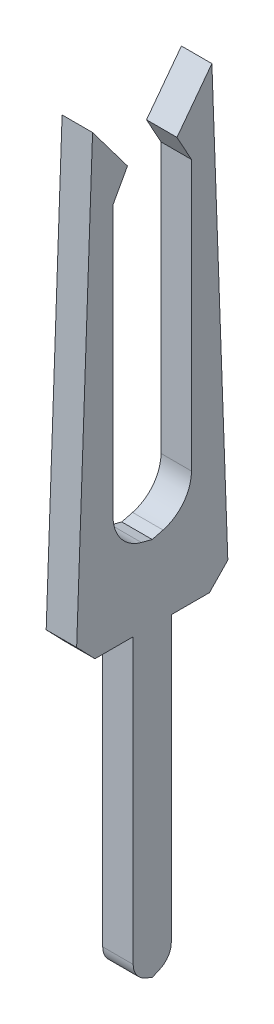
ISO-10303-21;
HEADER;
FILE_DESCRIPTION(('STEP AP214'),'2;1');
FILE_NAME('part.step','',(''),(''),'','','');
FILE_SCHEMA(('AUTOMOTIVE_DESIGN { 1 0 10303 214 1 1 1 1 }'));
ENDSEC;
DATA;
#1=APPLICATION_CONTEXT('core data for automotive mechanical design processes');
#2=APPLICATION_PROTOCOL_DEFINITION('international standard','automotive_design',2000,#1);
#3=PRODUCT_CONTEXT('',#1,'mechanical');
#4=PRODUCT('Part','Part','',(#3));
#5=PRODUCT_RELATED_PRODUCT_CATEGORY('part','',(#4));
#6=PRODUCT_DEFINITION_FORMATION('','',#4);
#7=PRODUCT_DEFINITION_CONTEXT('part definition',#1,'design');
#8=PRODUCT_DEFINITION('design','',#6,#7);
#9=PRODUCT_DEFINITION_SHAPE('','',#8);
#10=(LENGTH_UNIT() NAMED_UNIT(*) SI_UNIT(.MILLI.,.METRE.));
#11=(NAMED_UNIT(*) PLANE_ANGLE_UNIT() SI_UNIT($,.RADIAN.));
#12=(NAMED_UNIT(*) SI_UNIT($,.STERADIAN.) SOLID_ANGLE_UNIT());
#13=UNCERTAINTY_MEASURE_WITH_UNIT(LENGTH_MEASURE(1.E-05),#10,'distance_accuracy_value','');
#14=(GEOMETRIC_REPRESENTATION_CONTEXT(3) GLOBAL_UNCERTAINTY_ASSIGNED_CONTEXT((#13)) GLOBAL_UNIT_ASSIGNED_CONTEXT((#10,
#11,#12)) REPRESENTATION_CONTEXT('',''));
#15=CARTESIAN_POINT('',(0.,0.,0.));
#16=DIRECTION('',(0.,0.,1.));
#17=DIRECTION('',(1.,0.,0.));
#18=AXIS2_PLACEMENT_3D('',#15,#16,#17);
#19=CARTESIAN_POINT('',(0.4,2.15627423693323,0.277438328452502));
#20=DIRECTION('',(0.,0.694137309805425,0.71984261831048));
#21=DIRECTION('',(0.,-0.71984261831048,0.694137309805425));
#22=AXIS2_PLACEMENT_3D('',#19,#20,#21);
#23=PLANE('',#22);
#24=DIRECTION('',(0.,0.71984261831048,-0.694137309805425));
#25=VECTOR('',#24,1.);
#26=CARTESIAN_POINT('',(0.,2.15627423693323,0.277438328452502));
#27=LINE('',#26,#25);
#28=CARTESIAN_POINT('',(0.,1.90643942765456,0.518351630884458));
#29=VERTEX_POINT('',#28);
#30=CARTESIAN_POINT('',(0.,2.15627423693323,0.277438328452502));
#31=VERTEX_POINT('',#30);
#32=EDGE_CURVE('E222',#29,#31,#27,.T.);
#33=ORIENTED_EDGE('',*,*,#32,.T.);
#34=DIRECTION('',(-1.,0.,0.));
#35=VECTOR('',#34,1.);
#36=CARTESIAN_POINT('',(0.4,2.15627423693323,0.277438328452502));
#37=LINE('',#36,#35);
#38=CARTESIAN_POINT('',(0.4,2.15627423693323,0.277438328452502));
#39=VERTEX_POINT('',#38);
#40=EDGE_CURVE('E11',#39,#31,#37,.T.);
#41=ORIENTED_EDGE('',*,*,#40,.F.);
#42=DIRECTION('',(0.,0.71984261831048,-0.694137309805425));
#43=VECTOR('',#42,1.);
#44=CARTESIAN_POINT('',(0.4,2.15627423693323,0.277438328452502));
#45=LINE('',#44,#43);
#46=CARTESIAN_POINT('',(0.4,1.90643942765456,0.518351630884458));
#47=VERTEX_POINT('',#46);
#48=EDGE_CURVE('E285',#47,#39,#45,.T.);
#49=ORIENTED_EDGE('',*,*,#48,.F.);
#50=DIRECTION('',(-1.,0.,0.));
#51=VECTOR('',#50,1.);
#52=CARTESIAN_POINT('',(0.4,1.90643942765456,0.518351630884458));
#53=LINE('',#52,#51);
#54=EDGE_CURVE('E218',#47,#29,#53,.T.);
#55=ORIENTED_EDGE('',*,*,#54,.T.);
#56=EDGE_LOOP('',(#33,#41,#49,#55));
#57=FACE_BOUND('',#56,.T.);
#58=ADVANCED_FACE('F36',(#57),#23,.F.);
#59=CARTESIAN_POINT('',(0.4,7.90643942765456,0.486576567456251));
#60=DIRECTION('',(0.,-0.036346790272175,0.99933923711466));
#61=DIRECTION('',(0.,-0.99933923711466,-0.036346790272175));
#62=AXIS2_PLACEMENT_3D('',#59,#60,#61);
#63=PLANE('',#62);
#64=DIRECTION('',(0.,0.99933923711466,0.036346790272175));
#65=VECTOR('',#64,1.);
#66=CARTESIAN_POINT('',(0.,7.90643942765456,0.486576567456251));
#67=LINE('',#66,#65);
#68=CARTESIAN_POINT('',(0.,7.90643942765456,0.486576567456251));
#69=VERTEX_POINT('',#68);
#70=EDGE_CURVE('E226',#31,#69,#67,.T.);
#71=ORIENTED_EDGE('',*,*,#70,.T.);
#72=DIRECTION('',(-1.,0.,0.));
#73=VECTOR('',#72,1.);
#74=CARTESIAN_POINT('',(0.4,7.90643942765456,0.486576567456251));
#75=LINE('',#74,#73);
#76=CARTESIAN_POINT('',(0.4,7.90643942765456,0.486576567456251));
#77=VERTEX_POINT('',#76);
#78=EDGE_CURVE('E45',#77,#69,#75,.T.);
#79=ORIENTED_EDGE('',*,*,#78,.F.);
#80=DIRECTION('',(0.,0.99933923711466,0.036346790272175));
#81=VECTOR('',#80,1.);
#82=CARTESIAN_POINT('',(0.4,7.90643942765456,0.486576567456251));
#83=LINE('',#82,#81);
#84=EDGE_CURVE('E138',#39,#77,#83,.T.);
#85=ORIENTED_EDGE('',*,*,#84,.F.);
#86=ORIENTED_EDGE('',*,*,#40,.T.);
#87=EDGE_LOOP('',(#71,#79,#85,#86));
#88=FACE_BOUND('',#87,.T.);
#89=ADVANCED_FACE('F449',(#88),#63,.F.);
#90=CARTESIAN_POINT('',(0.4,7.29691604158744,0.944947879463951));
#91=DIRECTION('',(0.,-0.601030672473663,-0.799225957252301));
#92=DIRECTION('',(0.,0.799225957252301,-0.601030672473663));
#93=AXIS2_PLACEMENT_3D('',#90,#91,#92);
#94=PLANE('',#93);
#95=DIRECTION('',(0.,-0.799225957252301,0.601030672473663));
#96=VECTOR('',#95,1.);
#97=CARTESIAN_POINT('',(0.,7.29691604158744,0.944947879463951));
#98=LINE('',#97,#96);
#99=CARTESIAN_POINT('',(0.,7.29691604158744,0.944947879463951));
#100=VERTEX_POINT('',#99);
#101=EDGE_CURVE('E229',#69,#100,#98,.T.);
#102=ORIENTED_EDGE('',*,*,#101,.T.);
#103=DIRECTION('',(-1.,0.,0.));
#104=VECTOR('',#103,1.);
#105=CARTESIAN_POINT('',(0.4,7.29691604158744,0.944947879463951));
#106=LINE('',#105,#104);
#107=CARTESIAN_POINT('',(0.4,7.29691604158744,0.944947879463951));
#108=VERTEX_POINT('',#107);
#109=EDGE_CURVE('E352',#108,#100,#106,.T.);
#110=ORIENTED_EDGE('',*,*,#109,.F.);
#111=DIRECTION('',(0.,-0.799225957252301,0.601030672473663));
#112=VECTOR('',#111,1.);
#113=CARTESIAN_POINT('',(0.4,7.29691604158744,0.944947879463951));
#114=LINE('',#113,#112);
#115=EDGE_CURVE('E362',#77,#108,#114,.T.);
#116=ORIENTED_EDGE('',*,*,#115,.F.);
#117=ORIENTED_EDGE('',*,*,#78,.T.);
#118=EDGE_LOOP('',(#102,#110,#116,#117));
#119=FACE_BOUND('',#118,.T.);
#120=ADVANCED_FACE('F360',(#119),#94,.F.);
#121=CARTESIAN_POINT('',(0.4,6.95011825296304,0.754777343997982));
#122=DIRECTION('',(0.,0.480815317239039,-0.876821892238283));
#123=DIRECTION('',(0.,0.876821892238283,0.480815317239039));
#124=AXIS2_PLACEMENT_3D('',#121,#122,#123);
#125=PLANE('',#124);
#126=DIRECTION('',(0.,-0.876821892238283,-0.480815317239039));
#127=VECTOR('',#126,1.);
#128=CARTESIAN_POINT('',(0.,6.95011825296304,0.754777343997982));
#129=LINE('',#128,#127);
#130=CARTESIAN_POINT('',(0.,6.95011825296304,0.754777343997982));
#131=VERTEX_POINT('',#130);
#132=EDGE_CURVE('E232',#100,#131,#129,.T.);
#133=ORIENTED_EDGE('',*,*,#132,.T.);
#134=DIRECTION('',(-1.,0.,0.));
#135=VECTOR('',#134,1.);
#136=CARTESIAN_POINT('',(0.4,6.95011825296304,0.754777343997982));
#137=LINE('',#136,#135);
#138=CARTESIAN_POINT('',(0.4,6.95011825296304,0.754777343997982));
#139=VERTEX_POINT('',#138);
#140=EDGE_CURVE('E348',#139,#131,#137,.T.);
#141=ORIENTED_EDGE('',*,*,#140,.F.);
#142=DIRECTION('',(0.,-0.876821892238283,-0.480815317239039));
#143=VECTOR('',#142,1.);
#144=CARTESIAN_POINT('',(0.4,6.95011825296304,0.754777343997982));
#145=LINE('',#144,#143);
#146=EDGE_CURVE('E381',#108,#139,#145,.T.);
#147=ORIENTED_EDGE('',*,*,#146,.F.);
#148=ORIENTED_EDGE('',*,*,#109,.T.);
#149=EDGE_LOOP('',(#133,#141,#147,#148));
#150=FACE_BOUND('',#149,.T.);
#151=ADVANCED_FACE('F371',(#150),#125,.F.);
#152=CARTESIAN_POINT('',(0.4,3.40759606010662,0.754710604299908));
#153=DIRECTION('',(0.,1.88395991410638E-05,-0.999999999822535));
#154=DIRECTION('',(0.,0.999999999822535,1.88395991410638E-05));
#155=AXIS2_PLACEMENT_3D('',#152,#153,#154);
#156=PLANE('',#155);
#157=DIRECTION('',(0.,-0.999999999822535,-1.88395991410638E-05));
#158=VECTOR('',#157,1.);
#159=CARTESIAN_POINT('',(0.,3.40759606010662,0.754710604299908));
#160=LINE('',#159,#158);
#161=CARTESIAN_POINT('',(0.,3.40759606010662,0.754710604299908));
#162=VERTEX_POINT('',#161);
#163=EDGE_CURVE('E235',#131,#162,#160,.T.);
#164=ORIENTED_EDGE('',*,*,#163,.T.);
#165=DIRECTION('',(-1.,0.,0.));
#166=VECTOR('',#165,1.);
#167=CARTESIAN_POINT('',(0.4,3.40759606010662,0.754710604299908));
#168=LINE('',#167,#166);
#169=CARTESIAN_POINT('',(0.4,3.40759606010662,0.754710604299908));
#170=VERTEX_POINT('',#169);
#171=EDGE_CURVE('E344',#170,#162,#168,.T.);
#172=ORIENTED_EDGE('',*,*,#171,.F.);
#173=DIRECTION('',(0.,-0.999999999822535,-1.88395991410638E-05));
#174=VECTOR('',#173,1.);
#175=CARTESIAN_POINT('',(0.4,3.40759606010662,0.754710604299908));
#176=LINE('',#175,#174);
#177=EDGE_CURVE('E377',#139,#170,#176,.T.);
#178=ORIENTED_EDGE('',*,*,#177,.F.);
#179=ORIENTED_EDGE('',*,*,#140,.T.);
#180=EDGE_LOOP('',(#164,#172,#178,#179));
#181=FACE_BOUND('',#180,.T.);
#182=ADVANCED_FACE('F375',(#181),#156,.F.);
#183=CARTESIAN_POINT('',(0.4,3.40758664030705,1.25471060421118));
#184=DIRECTION('',(-1.,0.,0.));
#185=DIRECTION('',(0.,0.,1.));
#186=AXIS2_PLACEMENT_3D('',#183,#184,#185);
#187=CYLINDRICAL_SURFACE('',#186,0.5);
#188=CARTESIAN_POINT('',(0.,3.40758664030705,1.25471060421118));
#189=DIRECTION('',(-1.,0.,0.));
#190=DIRECTION('',(0.,0.,-1.));
#191=AXIS2_PLACEMENT_3D('',#188,#189,#190);
#192=CIRCLE('',#191,0.5);
#193=CARTESIAN_POINT('',(0.,2.92391221511593,1.127986295509));
#194=VERTEX_POINT('',#193);
#195=EDGE_CURVE('E238',#162,#194,#192,.T.);
#196=ORIENTED_EDGE('',*,*,#195,.T.);
#197=DIRECTION('',(-1.,0.,0.));
#198=VECTOR('',#197,1.);
#199=CARTESIAN_POINT('',(0.4,2.92391221511593,1.127986295509));
#200=LINE('',#199,#198);
#201=CARTESIAN_POINT('',(0.4,2.92391221511593,1.127986295509));
#202=VERTEX_POINT('',#201);
#203=EDGE_CURVE('E340',#202,#194,#200,.T.);
#204=ORIENTED_EDGE('',*,*,#203,.F.);
#205=CARTESIAN_POINT('',(0.4,3.40758664030705,1.25471060421118));
#206=DIRECTION('',(-1.,0.,0.));
#207=DIRECTION('',(0.,0.,-1.));
#208=AXIS2_PLACEMENT_3D('',#205,#206,#207);
#209=CIRCLE('',#208,0.5);
#210=EDGE_CURVE('E380',#170,#202,#209,.T.);
#211=ORIENTED_EDGE('',*,*,#210,.F.);
#212=ORIENTED_EDGE('',*,*,#171,.T.);
#213=EDGE_LOOP('',(#196,#204,#211,#212));
#214=FACE_BOUND('',#213,.T.);
#215=ADVANCED_FACE('F462',(#214),#187,.F.);
#216=CARTESIAN_POINT('',(0.4,2.88671780777912,1.26994787946395));
#217=DIRECTION('',(0.,-0.967348850382229,-0.253448617404358));
#218=DIRECTION('',(0.,0.253448617404358,-0.967348850382229));
#219=AXIS2_PLACEMENT_3D('',#216,#217,#218);
#220=PLANE('',#219);
#221=DIRECTION('',(0.,-0.253448617404358,0.967348850382229));
#222=VECTOR('',#221,1.);
#223=CARTESIAN_POINT('',(0.,2.88671780777912,1.26994787946395));
#224=LINE('',#223,#222);
#225=CARTESIAN_POINT('',(0.,2.88671780777912,1.26994787946395));
#226=VERTEX_POINT('',#225);
#227=EDGE_CURVE('E241',#194,#226,#224,.T.);
#228=ORIENTED_EDGE('',*,*,#227,.T.);
#229=DIRECTION('',(-1.,0.,0.));
#230=VECTOR('',#229,1.);
#231=CARTESIAN_POINT('',(0.4,2.88671780777912,1.26994787946395));
#232=LINE('',#231,#230);
#233=CARTESIAN_POINT('',(0.4,2.88671780777912,1.26994787946395));
#234=VERTEX_POINT('',#233);
#235=EDGE_CURVE('E336',#234,#226,#232,.T.);
#236=ORIENTED_EDGE('',*,*,#235,.F.);
#237=DIRECTION('',(0.,-0.253448617404358,0.967348850382229));
#238=VECTOR('',#237,1.);
#239=CARTESIAN_POINT('',(0.4,2.88671780777912,1.26994787946395));
#240=LINE('',#239,#238);
#241=EDGE_CURVE('E384',#202,#234,#240,.T.);
#242=ORIENTED_EDGE('',*,*,#241,.F.);
#243=ORIENTED_EDGE('',*,*,#203,.T.);
#244=EDGE_LOOP('',(#228,#236,#242,#243));
#245=FACE_BOUND('',#244,.T.);
#246=ADVANCED_FACE('F465',(#245),#220,.F.);
#247=CARTESIAN_POINT('',(0.4,2.88671780777912,1.26994787946395));
#248=DIRECTION('',(0.,-0.967348850382229,0.253448617404358));
#249=DIRECTION('',(0.,-0.253448617404358,-0.967348850382229));
#250=AXIS2_PLACEMENT_3D('',#247,#248,#249);
#251=PLANE('',#250);
#252=DIRECTION('',(0.,0.253448617404358,0.967348850382229));
#253=VECTOR('',#252,1.);
#254=CARTESIAN_POINT('',(0.,2.88671780777912,1.26994787946395));
#255=LINE('',#254,#253);
#256=CARTESIAN_POINT('',(0.,2.92391221511593,1.4119094634189));
#257=VERTEX_POINT('',#256);
#258=EDGE_CURVE('E244',#226,#257,#255,.T.);
#259=ORIENTED_EDGE('',*,*,#258,.T.);
#260=DIRECTION('',(-1.,0.,0.));
#261=VECTOR('',#260,1.);
#262=CARTESIAN_POINT('',(0.4,2.92391221511593,1.4119094634189));
#263=LINE('',#262,#261);
#264=CARTESIAN_POINT('',(0.4,2.92391221511593,1.4119094634189));
#265=VERTEX_POINT('',#264);
#266=EDGE_CURVE('E332',#265,#257,#263,.T.);
#267=ORIENTED_EDGE('',*,*,#266,.F.);
#268=DIRECTION('',(0.,0.253448617404358,0.967348850382229));
#269=VECTOR('',#268,1.);
#270=CARTESIAN_POINT('',(0.4,2.88671780777912,1.26994787946395));
#271=LINE('',#270,#269);
#272=EDGE_CURVE('E392',#234,#265,#271,.T.);
#273=ORIENTED_EDGE('',*,*,#272,.F.);
#274=ORIENTED_EDGE('',*,*,#235,.T.);
#275=EDGE_LOOP('',(#259,#267,#273,#274));
#276=FACE_BOUND('',#275,.T.);
#277=ADVANCED_FACE('F469',(#276),#251,.F.);
#278=CARTESIAN_POINT('',(0.4,3.40758664030705,1.28518515471672));
#279=DIRECTION('',(-1.,0.,0.));
#280=DIRECTION('',(0.,0.,1.));
#281=AXIS2_PLACEMENT_3D('',#278,#279,#280);
#282=CYLINDRICAL_SURFACE('',#281,0.5);
#283=CARTESIAN_POINT('',(0.,3.40758664030705,1.28518515471672));
#284=DIRECTION('',(-1.,0.,0.));
#285=DIRECTION('',(0.,0.,1.));
#286=AXIS2_PLACEMENT_3D('',#283,#284,#285);
#287=CIRCLE('',#286,0.5);
#288=CARTESIAN_POINT('',(0.,3.40759606010662,1.78518515462799));
#289=VERTEX_POINT('',#288);
#290=EDGE_CURVE('E247',#257,#289,#287,.T.);
#291=ORIENTED_EDGE('',*,*,#290,.T.);
#292=DIRECTION('',(-1.,0.,0.));
#293=VECTOR('',#292,1.);
#294=CARTESIAN_POINT('',(0.4,3.40759606010662,1.78518515462799));
#295=LINE('',#294,#293);
#296=CARTESIAN_POINT('',(0.4,3.40759606010662,1.78518515462799));
#297=VERTEX_POINT('',#296);
#298=EDGE_CURVE('E328',#297,#289,#295,.T.);
#299=ORIENTED_EDGE('',*,*,#298,.F.);
#300=CARTESIAN_POINT('',(0.4,3.40758664030705,1.28518515471672));
#301=DIRECTION('',(-1.,0.,0.));
#302=DIRECTION('',(0.,0.,1.));
#303=AXIS2_PLACEMENT_3D('',#300,#301,#302);
#304=CIRCLE('',#303,0.5);
#305=EDGE_CURVE('E395',#265,#297,#304,.T.);
#306=ORIENTED_EDGE('',*,*,#305,.F.);
#307=ORIENTED_EDGE('',*,*,#266,.T.);
#308=EDGE_LOOP('',(#291,#299,#306,#307));
#309=FACE_BOUND('',#308,.T.);
#310=ADVANCED_FACE('F473',(#309),#282,.F.);
#311=CARTESIAN_POINT('',(0.4,3.40759606010662,1.78518515462799));
#312=DIRECTION('',(0.,1.88395991408802E-05,0.999999999822535));
#313=DIRECTION('',(0.,-0.999999999822535,1.88395991408802E-05));
#314=AXIS2_PLACEMENT_3D('',#311,#312,#313);
#315=PLANE('',#314);
#316=DIRECTION('',(0.,0.999999999822535,-1.88395991408802E-05));
#317=VECTOR('',#316,1.);
#318=CARTESIAN_POINT('',(0.,3.40759606010662,1.78518515462799));
#319=LINE('',#318,#317);
#320=CARTESIAN_POINT('',(0.,6.95011825296304,1.78511841492992));
#321=VERTEX_POINT('',#320);
#322=EDGE_CURVE('E250',#289,#321,#319,.T.);
#323=ORIENTED_EDGE('',*,*,#322,.T.);
#324=DIRECTION('',(-1.,0.,0.));
#325=VECTOR('',#324,1.);
#326=CARTESIAN_POINT('',(0.4,6.95011825296304,1.78511841492992));
#327=LINE('',#326,#325);
#328=CARTESIAN_POINT('',(0.4,6.95011825296304,1.78511841492992));
#329=VERTEX_POINT('',#328);
#330=EDGE_CURVE('E324',#329,#321,#327,.T.);
#331=ORIENTED_EDGE('',*,*,#330,.F.);
#332=DIRECTION('',(0.,0.999999999822535,-1.88395991408802E-05));
#333=VECTOR('',#332,1.);
#334=CARTESIAN_POINT('',(0.4,3.40759606010662,1.78518515462799));
#335=LINE('',#334,#333);
#336=EDGE_CURVE('E398',#297,#329,#335,.T.);
#337=ORIENTED_EDGE('',*,*,#336,.F.);
#338=ORIENTED_EDGE('',*,*,#298,.T.);
#339=EDGE_LOOP('',(#323,#331,#337,#338));
#340=FACE_BOUND('',#339,.T.);
#341=ADVANCED_FACE('F477',(#340),#315,.F.);
#342=CARTESIAN_POINT('',(0.4,6.95011825296304,1.78511841492992));
#343=DIRECTION('',(0.,0.480815317239038,0.876821892238283));
#344=DIRECTION('',(0.,-0.876821892238283,0.480815317239038));
#345=AXIS2_PLACEMENT_3D('',#342,#343,#344);
#346=PLANE('',#345);
#347=DIRECTION('',(0.,0.876821892238283,-0.480815317239038));
#348=VECTOR('',#347,1.);
#349=CARTESIAN_POINT('',(0.,6.95011825296304,1.78511841492992));
#350=LINE('',#349,#348);
#351=CARTESIAN_POINT('',(0.,7.29691604158744,1.59494787946395));
#352=VERTEX_POINT('',#351);
#353=EDGE_CURVE('E253',#321,#352,#350,.T.);
#354=ORIENTED_EDGE('',*,*,#353,.T.);
#355=DIRECTION('',(-1.,0.,0.));
#356=VECTOR('',#355,1.);
#357=CARTESIAN_POINT('',(0.4,7.29691604158744,1.59494787946395));
#358=LINE('',#357,#356);
#359=CARTESIAN_POINT('',(0.4,7.29691604158744,1.59494787946395));
#360=VERTEX_POINT('',#359);
#361=EDGE_CURVE('E320',#360,#352,#358,.T.);
#362=ORIENTED_EDGE('',*,*,#361,.F.);
#363=DIRECTION('',(0.,0.876821892238283,-0.480815317239038));
#364=VECTOR('',#363,1.);
#365=CARTESIAN_POINT('',(0.4,6.95011825296304,1.78511841492992));
#366=LINE('',#365,#364);
#367=EDGE_CURVE('E401',#329,#360,#366,.T.);
#368=ORIENTED_EDGE('',*,*,#367,.F.);
#369=ORIENTED_EDGE('',*,*,#330,.T.);
#370=EDGE_LOOP('',(#354,#362,#368,#369));
#371=FACE_BOUND('',#370,.T.);
#372=ADVANCED_FACE('F481',(#371),#346,.F.);
#373=CARTESIAN_POINT('',(0.4,7.29691604158744,1.59494787946395));
#374=DIRECTION('',(0.,-0.601030672473662,0.799225957252301));
#375=DIRECTION('',(0.,-0.799225957252301,-0.601030672473662));
#376=AXIS2_PLACEMENT_3D('',#373,#374,#375);
#377=PLANE('',#376);
#378=DIRECTION('',(0.,0.799225957252301,0.601030672473662));
#379=VECTOR('',#378,1.);
#380=CARTESIAN_POINT('',(0.,7.29691604158744,1.59494787946395));
#381=LINE('',#380,#379);
#382=CARTESIAN_POINT('',(0.,7.90643942765456,2.05331919147165));
#383=VERTEX_POINT('',#382);
#384=EDGE_CURVE('E256',#352,#383,#381,.T.);
#385=ORIENTED_EDGE('',*,*,#384,.T.);
#386=DIRECTION('',(-1.,0.,0.));
#387=VECTOR('',#386,1.);
#388=CARTESIAN_POINT('',(0.4,7.90643942765456,2.05331919147165));
#389=LINE('',#388,#387);
#390=CARTESIAN_POINT('',(0.4,7.90643942765456,2.05331919147165));
#391=VERTEX_POINT('',#390);
#392=EDGE_CURVE('E316',#391,#383,#389,.T.);
#393=ORIENTED_EDGE('',*,*,#392,.F.);
#394=DIRECTION('',(0.,0.799225957252301,0.601030672473662));
#395=VECTOR('',#394,1.);
#396=CARTESIAN_POINT('',(0.4,7.29691604158744,1.59494787946395));
#397=LINE('',#396,#395);
#398=EDGE_CURVE('E404',#360,#391,#397,.T.);
#399=ORIENTED_EDGE('',*,*,#398,.F.);
#400=ORIENTED_EDGE('',*,*,#361,.T.);
#401=EDGE_LOOP('',(#385,#393,#399,#400));
#402=FACE_BOUND('',#401,.T.);
#403=ADVANCED_FACE('F485',(#402),#377,.F.);
#404=CARTESIAN_POINT('',(0.4,7.90643942765456,2.05331919147165));
#405=DIRECTION('',(0.,-0.0363467902721749,-0.99933923711466));
#406=DIRECTION('',(0.,0.99933923711466,-0.0363467902721749));
#407=AXIS2_PLACEMENT_3D('',#404,#405,#406);
#408=PLANE('',#407);
#409=DIRECTION('',(0.,-0.99933923711466,0.0363467902721749));
#410=VECTOR('',#409,1.);
#411=CARTESIAN_POINT('',(0.,7.90643942765456,2.05331919147165));
#412=LINE('',#411,#410);
#413=CARTESIAN_POINT('',(0.,2.15627423693323,2.26245743047539));
#414=VERTEX_POINT('',#413);
#415=EDGE_CURVE('E259',#383,#414,#412,.T.);
#416=ORIENTED_EDGE('',*,*,#415,.T.);
#417=DIRECTION('',(-1.,0.,0.));
#418=VECTOR('',#417,1.);
#419=CARTESIAN_POINT('',(0.4,2.15627423693323,2.26245743047539));
#420=LINE('',#419,#418);
#421=CARTESIAN_POINT('',(0.4,2.15627423693323,2.26245743047539));
#422=VERTEX_POINT('',#421);
#423=EDGE_CURVE('E312',#422,#414,#420,.T.);
#424=ORIENTED_EDGE('',*,*,#423,.F.);
#425=DIRECTION('',(0.,-0.99933923711466,0.0363467902721749));
#426=VECTOR('',#425,1.);
#427=CARTESIAN_POINT('',(0.4,7.90643942765456,2.05331919147165));
#428=LINE('',#427,#426);
#429=EDGE_CURVE('E407',#391,#422,#428,.T.);
#430=ORIENTED_EDGE('',*,*,#429,.F.);
#431=ORIENTED_EDGE('',*,*,#392,.T.);
#432=EDGE_LOOP('',(#416,#424,#430,#431));
#433=FACE_BOUND('',#432,.T.);
#434=ADVANCED_FACE('F489',(#433),#408,.F.);
#435=CARTESIAN_POINT('',(0.4,2.15627423693323,2.26245743047539));
#436=DIRECTION('',(0.,0.694137309805425,-0.71984261831048));
#437=DIRECTION('',(0.,0.71984261831048,0.694137309805426));
#438=AXIS2_PLACEMENT_3D('',#435,#436,#437);
#439=PLANE('',#438);
#440=DIRECTION('',(0.,-0.71984261831048,-0.694137309805426));
#441=VECTOR('',#440,1.);
#442=CARTESIAN_POINT('',(0.,2.15627423693323,2.26245743047539));
#443=LINE('',#442,#441);
#444=CARTESIAN_POINT('',(0.,1.90643942765456,2.02154412804344));
#445=VERTEX_POINT('',#444);
#446=EDGE_CURVE('E262',#414,#445,#443,.T.);
#447=ORIENTED_EDGE('',*,*,#446,.T.);
#448=DIRECTION('',(-1.,0.,0.));
#449=VECTOR('',#448,1.);
#450=CARTESIAN_POINT('',(0.4,1.90643942765456,2.02154412804344));
#451=LINE('',#450,#449);
#452=CARTESIAN_POINT('',(0.4,1.90643942765456,2.02154412804344));
#453=VERTEX_POINT('',#452);
#454=EDGE_CURVE('E308',#453,#445,#451,.T.);
#455=ORIENTED_EDGE('',*,*,#454,.F.);
#456=DIRECTION('',(0.,-0.71984261831048,-0.694137309805426));
#457=VECTOR('',#456,1.);
#458=CARTESIAN_POINT('',(0.4,2.15627423693323,2.26245743047539));
#459=LINE('',#458,#457);
#460=EDGE_CURVE('E410',#422,#453,#459,.T.);
#461=ORIENTED_EDGE('',*,*,#460,.F.);
#462=ORIENTED_EDGE('',*,*,#423,.T.);
#463=EDGE_LOOP('',(#447,#455,#461,#462));
#464=FACE_BOUND('',#463,.T.);
#465=ADVANCED_FACE('F493',(#464),#439,.F.);
#466=CARTESIAN_POINT('',(0.4,1.90643942765456,2.02154412804344));
#467=DIRECTION('',(0.,1.,0.));
#468=DIRECTION('',(0.,0.,1.));
#469=AXIS2_PLACEMENT_3D('',#466,#467,#468);
#470=PLANE('',#469);
#471=DIRECTION('',(0.,0.,-1.));
#472=VECTOR('',#471,1.);
#473=CARTESIAN_POINT('',(0.,1.90643942765456,2.02154412804344));
#474=LINE('',#473,#472);
#475=CARTESIAN_POINT('',(0.,1.90643942765456,1.51994787946395));
#476=VERTEX_POINT('',#475);
#477=EDGE_CURVE('E265',#445,#476,#474,.T.);
#478=ORIENTED_EDGE('',*,*,#477,.T.);
#479=DIRECTION('',(-1.,0.,0.));
#480=VECTOR('',#479,1.);
#481=CARTESIAN_POINT('',(0.4,1.90643942765456,1.51994787946395));
#482=LINE('',#481,#480);
#483=CARTESIAN_POINT('',(0.4,1.90643942765456,1.51994787946395));
#484=VERTEX_POINT('',#483);
#485=EDGE_CURVE('E304',#484,#476,#482,.T.);
#486=ORIENTED_EDGE('',*,*,#485,.F.);
#487=DIRECTION('',(0.,0.,-1.));
#488=VECTOR('',#487,1.);
#489=CARTESIAN_POINT('',(0.4,1.90643942765456,2.02154412804344));
#490=LINE('',#489,#488);
#491=EDGE_CURVE('E413',#453,#484,#490,.T.);
#492=ORIENTED_EDGE('',*,*,#491,.F.);
#493=ORIENTED_EDGE('',*,*,#454,.T.);
#494=EDGE_LOOP('',(#478,#486,#492,#493));
#495=FACE_BOUND('',#494,.T.);
#496=ADVANCED_FACE('F497',(#495),#470,.F.);
#497=CARTESIAN_POINT('',(0.4,1.90643942765456,1.51994787946395));
#498=DIRECTION('',(0.,0.,-1.));
#499=DIRECTION('',(0.,1.,0.));
#500=AXIS2_PLACEMENT_3D('',#497,#498,#499);
#501=PLANE('',#500);
#502=DIRECTION('',(0.,-1.,0.));
#503=VECTOR('',#502,1.);
#504=CARTESIAN_POINT('',(0.,1.90643942765456,1.51994787946395));
#505=LINE('',#504,#503);
#506=CARTESIAN_POINT('',(0.,-1.82003778744792,1.51994787946395));
#507=VERTEX_POINT('',#506);
#508=EDGE_CURVE('E268',#476,#507,#505,.T.);
#509=ORIENTED_EDGE('',*,*,#508,.T.);
#510=DIRECTION('',(-1.,0.,0.));
#511=VECTOR('',#510,1.);
#512=CARTESIAN_POINT('',(0.4,-1.82003778744792,1.51994787946395));
#513=LINE('',#512,#511);
#514=CARTESIAN_POINT('',(0.4,-1.82003778744792,1.51994787946395));
#515=VERTEX_POINT('',#514);
#516=EDGE_CURVE('E300',#515,#507,#513,.T.);
#517=ORIENTED_EDGE('',*,*,#516,.F.);
#518=DIRECTION('',(0.,-1.,0.));
#519=VECTOR('',#518,1.);
#520=CARTESIAN_POINT('',(0.4,1.90643942765456,1.51994787946395));
#521=LINE('',#520,#519);
#522=EDGE_CURVE('E416',#484,#515,#521,.T.);
#523=ORIENTED_EDGE('',*,*,#522,.F.);
#524=ORIENTED_EDGE('',*,*,#485,.T.);
#525=EDGE_LOOP('',(#509,#517,#523,#524));
#526=FACE_BOUND('',#525,.T.);
#527=ADVANCED_FACE('F501',(#526),#501,.F.);
#528=CARTESIAN_POINT('',(0.4,-1.82003778744792,1.26994787946395));
#529=DIRECTION('',(-1.,0.,0.));
#530=DIRECTION('',(0.,0.,1.));
#531=AXIS2_PLACEMENT_3D('',#528,#529,#530);
#532=CYLINDRICAL_SURFACE('',#531,0.249999999999999);
#533=CARTESIAN_POINT('',(0.,-1.82003778744792,1.26994787946395));
#534=DIRECTION('',(1.,0.,0.));
#535=DIRECTION('',(0.,0.,-1.));
#536=AXIS2_PLACEMENT_3D('',#533,#534,#535);
#537=CIRCLE('',#536,0.249999999999999);
#538=CARTESIAN_POINT('',(0.,-2.04853794703578,1.37137606621853));
#539=VERTEX_POINT('',#538);
#540=EDGE_CURVE('E271',#507,#539,#537,.T.);
#541=ORIENTED_EDGE('',*,*,#540,.T.);
#542=DIRECTION('',(-1.,0.,0.));
#543=VECTOR('',#542,1.);
#544=CARTESIAN_POINT('',(0.4,-2.04853794703578,1.37137606621853));
#545=LINE('',#544,#543);
#546=CARTESIAN_POINT('',(0.4,-2.04853794703578,1.37137606621853));
#547=VERTEX_POINT('',#546);
#548=EDGE_CURVE('E296',#547,#539,#545,.T.);
#549=ORIENTED_EDGE('',*,*,#548,.F.);
#550=CARTESIAN_POINT('',(0.4,-1.82003778744792,1.26994787946395));
#551=DIRECTION('',(1.,0.,0.));
#552=DIRECTION('',(0.,0.,-1.));
#553=AXIS2_PLACEMENT_3D('',#550,#551,#552);
#554=CIRCLE('',#553,0.249999999999999);
#555=EDGE_CURVE('E419',#515,#547,#554,.T.);
#556=ORIENTED_EDGE('',*,*,#555,.F.);
#557=ORIENTED_EDGE('',*,*,#516,.T.);
#558=EDGE_LOOP('',(#541,#549,#556,#557));
#559=FACE_BOUND('',#558,.T.);
#560=ADVANCED_FACE('F505',(#559),#532,.T.);
#561=CARTESIAN_POINT('',(0.4,-2.04853794703578,1.37137606621853));
#562=DIRECTION('',(0.,0.914000638351446,-0.405712747018317));
#563=DIRECTION('',(0.,0.405712747018317,0.914000638351446));
#564=AXIS2_PLACEMENT_3D('',#561,#562,#563);
#565=PLANE('',#564);
#566=DIRECTION('',(0.,-0.405712747018317,-0.914000638351446));
#567=VECTOR('',#566,1.);
#568=CARTESIAN_POINT('',(0.,-2.04853794703578,1.37137606621853));
#569=LINE('',#568,#567);
#570=CARTESIAN_POINT('',(0.,-2.09356057234545,1.26994787946395));
#571=VERTEX_POINT('',#570);
#572=EDGE_CURVE('E274',#539,#571,#569,.T.);
#573=ORIENTED_EDGE('',*,*,#572,.T.);
#574=DIRECTION('',(-1.,0.,0.));
#575=VECTOR('',#574,1.);
#576=CARTESIAN_POINT('',(0.4,-2.09356057234545,1.26994787946395));
#577=LINE('',#576,#575);
#578=CARTESIAN_POINT('',(0.4,-2.09356057234545,1.26994787946395));
#579=VERTEX_POINT('',#578);
#580=EDGE_CURVE('E292',#579,#571,#577,.T.);
#581=ORIENTED_EDGE('',*,*,#580,.F.);
#582=DIRECTION('',(0.,-0.405712747018317,-0.914000638351446));
#583=VECTOR('',#582,1.);
#584=CARTESIAN_POINT('',(0.4,-2.04853794703578,1.37137606621853));
#585=LINE('',#584,#583);
#586=EDGE_CURVE('E422',#547,#579,#585,.T.);
#587=ORIENTED_EDGE('',*,*,#586,.F.);
#588=ORIENTED_EDGE('',*,*,#548,.T.);
#589=EDGE_LOOP('',(#573,#581,#587,#588));
#590=FACE_BOUND('',#589,.T.);
#591=ADVANCED_FACE('F430',(#590),#565,.F.);
#592=CARTESIAN_POINT('',(0.4,-2.04853794703579,1.16851969270938));
#593=DIRECTION('',(0.,0.914000638351438,0.405712747018336));
#594=DIRECTION('',(0.,-0.405712747018336,0.914000638351438));
#595=AXIS2_PLACEMENT_3D('',#592,#593,#594);
#596=PLANE('',#595);
#597=DIRECTION('',(0.,0.405712747018336,-0.914000638351438));
#598=VECTOR('',#597,1.);
#599=CARTESIAN_POINT('',(0.,-2.04853794703579,1.16851969270938));
#600=LINE('',#599,#598);
#601=CARTESIAN_POINT('',(0.,-2.04853794703579,1.16851969270938));
#602=VERTEX_POINT('',#601);
#603=EDGE_CURVE('E277',#571,#602,#600,.T.);
#604=ORIENTED_EDGE('',*,*,#603,.T.);
#605=DIRECTION('',(-1.,0.,0.));
#606=VECTOR('',#605,1.);
#607=CARTESIAN_POINT('',(0.4,-2.04853794703579,1.16851969270938));
#608=LINE('',#607,#606);
#609=CARTESIAN_POINT('',(0.4,-2.04853794703579,1.16851969270938));
#610=VERTEX_POINT('',#609);
#611=EDGE_CURVE('E210',#610,#602,#608,.T.);
#612=ORIENTED_EDGE('',*,*,#611,.F.);
#613=DIRECTION('',(0.,0.405712747018336,-0.914000638351438));
#614=VECTOR('',#613,1.);
#615=CARTESIAN_POINT('',(0.4,-2.04853794703579,1.16851969270938));
#616=LINE('',#615,#614);
#617=EDGE_CURVE('E199',#579,#610,#616,.T.);
#618=ORIENTED_EDGE('',*,*,#617,.F.);
#619=ORIENTED_EDGE('',*,*,#580,.T.);
#620=EDGE_LOOP('',(#604,#612,#618,#619));
#621=FACE_BOUND('',#620,.T.);
#622=ADVANCED_FACE('F434',(#621),#596,.F.);
#623=CARTESIAN_POINT('',(0.4,-1.82003778744792,1.26994787946395));
#624=DIRECTION('',(-1.,0.,0.));
#625=DIRECTION('',(0.,0.,1.));
#626=AXIS2_PLACEMENT_3D('',#623,#624,#625);
#627=CYLINDRICAL_SURFACE('',#626,0.25);
#628=CARTESIAN_POINT('',(0.,-1.82003778744792,1.26994787946395));
#629=DIRECTION('',(1.,0.,0.));
#630=DIRECTION('',(0.,0.,1.));
#631=AXIS2_PLACEMENT_3D('',#628,#629,#630);
#632=CIRCLE('',#631,0.25);
#633=CARTESIAN_POINT('',(0.,-1.82003778744792,1.01994787946395));
#634=VERTEX_POINT('',#633);
#635=EDGE_CURVE('E208',#602,#634,#632,.T.);
#636=ORIENTED_EDGE('',*,*,#635,.T.);
#637=DIRECTION('',(-1.,0.,0.));
#638=VECTOR('',#637,1.);
#639=CARTESIAN_POINT('',(0.4,-1.82003778744792,1.01994787946395));
#640=LINE('',#639,#638);
#641=CARTESIAN_POINT('',(0.4,-1.82003778744792,1.01994787946395));
#642=VERTEX_POINT('',#641);
#643=EDGE_CURVE('E205',#642,#634,#640,.T.);
#644=ORIENTED_EDGE('',*,*,#643,.F.);
#645=CARTESIAN_POINT('',(0.4,-1.82003778744792,1.26994787946395));
#646=DIRECTION('',(1.,0.,0.));
#647=DIRECTION('',(0.,0.,1.));
#648=AXIS2_PLACEMENT_3D('',#645,#646,#647);
#649=CIRCLE('',#648,0.25);
#650=EDGE_CURVE('E193',#610,#642,#649,.T.);
#651=ORIENTED_EDGE('',*,*,#650,.F.);
#652=ORIENTED_EDGE('',*,*,#611,.T.);
#653=EDGE_LOOP('',(#636,#644,#651,#652));
#654=FACE_BOUND('',#653,.T.);
#655=ADVANCED_FACE('F206',(#654),#627,.T.);
#656=CARTESIAN_POINT('',(0.4,1.90643942765456,1.01994787946395));
#657=DIRECTION('',(0.,0.,1.));
#658=DIRECTION('',(1.,0.,0.));
#659=AXIS2_PLACEMENT_3D('',#656,#657,#658);
#660=PLANE('',#659);
#661=DIRECTION('',(0.,1.,0.));
#662=VECTOR('',#661,1.);
#663=CARTESIAN_POINT('',(0.,1.90643942765456,1.01994787946395));
#664=LINE('',#663,#662);
#665=CARTESIAN_POINT('',(0.,1.90643942765456,1.01994787946395));
#666=VERTEX_POINT('',#665);
#667=EDGE_CURVE('E124',#634,#666,#664,.T.);
#668=ORIENTED_EDGE('',*,*,#667,.T.);
#669=DIRECTION('',(-1.,0.,0.));
#670=VECTOR('',#669,1.);
#671=CARTESIAN_POINT('',(0.4,1.90643942765456,1.01994787946395));
#672=LINE('',#671,#670);
#673=CARTESIAN_POINT('',(0.4,1.90643942765456,1.01994787946395));
#674=VERTEX_POINT('',#673);
#675=EDGE_CURVE('E211',#674,#666,#672,.T.);
#676=ORIENTED_EDGE('',*,*,#675,.F.);
#677=DIRECTION('',(0.,1.,0.));
#678=VECTOR('',#677,1.);
#679=CARTESIAN_POINT('',(0.4,1.90643942765456,1.01994787946395));
#680=LINE('',#679,#678);
#681=EDGE_CURVE('E197',#642,#674,#680,.T.);
#682=ORIENTED_EDGE('',*,*,#681,.F.);
#683=ORIENTED_EDGE('',*,*,#643,.T.);
#684=EDGE_LOOP('',(#668,#676,#682,#683));
#685=FACE_BOUND('',#684,.T.);
#686=ADVANCED_FACE('F213',(#685),#660,.F.);
#687=CARTESIAN_POINT('',(0.4,1.90643942765456,0.518351630884458));
#688=DIRECTION('',(0.,1.,0.));
#689=DIRECTION('',(0.,0.,1.));
#690=AXIS2_PLACEMENT_3D('',#687,#688,#689);
#691=PLANE('',#690);
#692=DIRECTION('',(0.,0.,-1.));
#693=VECTOR('',#692,1.);
#694=CARTESIAN_POINT('',(0.,1.90643942765456,0.518351630884458));
#695=LINE('',#694,#693);
#696=EDGE_CURVE('E130',#666,#29,#695,.T.);
#697=ORIENTED_EDGE('',*,*,#696,.T.);
#698=ORIENTED_EDGE('',*,*,#54,.F.);
#699=DIRECTION('',(0.,0.,-1.));
#700=VECTOR('',#699,1.);
#701=CARTESIAN_POINT('',(0.4,1.90643942765456,0.518351630884458));
#702=LINE('',#701,#700);
#703=EDGE_CURVE('E53',#674,#47,#702,.T.);
#704=ORIENTED_EDGE('',*,*,#703,.F.);
#705=ORIENTED_EDGE('',*,*,#675,.T.);
#706=EDGE_LOOP('',(#697,#698,#704,#705));
#707=FACE_BOUND('',#706,.T.);
#708=ADVANCED_FACE('F438',(#707),#691,.F.);
#709=CARTESIAN_POINT('',(0.4,-1.82003778744792,1.26994787946395));
#710=DIRECTION('',(-1.,0.,0.));
#711=DIRECTION('',(0.,0.,1.));
#712=AXIS2_PLACEMENT_3D('',#709,#710,#711);
#713=PLANE('',#712);
#714=ORIENTED_EDGE('',*,*,#48,.T.);
#715=ORIENTED_EDGE('',*,*,#84,.T.);
#716=ORIENTED_EDGE('',*,*,#115,.T.);
#717=ORIENTED_EDGE('',*,*,#146,.T.);
#718=ORIENTED_EDGE('',*,*,#177,.T.);
#719=ORIENTED_EDGE('',*,*,#210,.T.);
#720=ORIENTED_EDGE('',*,*,#241,.T.);
#721=ORIENTED_EDGE('',*,*,#272,.T.);
#722=ORIENTED_EDGE('',*,*,#305,.T.);
#723=ORIENTED_EDGE('',*,*,#336,.T.);
#724=ORIENTED_EDGE('',*,*,#367,.T.);
#725=ORIENTED_EDGE('',*,*,#398,.T.);
#726=ORIENTED_EDGE('',*,*,#429,.T.);
#727=ORIENTED_EDGE('',*,*,#460,.T.);
#728=ORIENTED_EDGE('',*,*,#491,.T.);
#729=ORIENTED_EDGE('',*,*,#522,.T.);
#730=ORIENTED_EDGE('',*,*,#555,.T.);
#731=ORIENTED_EDGE('',*,*,#586,.T.);
#732=ORIENTED_EDGE('',*,*,#617,.T.);
#733=ORIENTED_EDGE('',*,*,#650,.T.);
#734=ORIENTED_EDGE('',*,*,#681,.T.);
#735=ORIENTED_EDGE('',*,*,#703,.T.);
#736=EDGE_LOOP('',(#714,#715,#716,#717,#718,#719,#720,#721,#722,#723,#724,#725,#726,#727,#728,
#729,#730,#731,#732,#733,#734,#735));
#737=FACE_BOUND('',#736,.T.);
#738=ADVANCED_FACE('F195',(#737),#713,.F.);
#739=CARTESIAN_POINT('',(0.,-1.82003778744792,1.26994787946395));
#740=DIRECTION('',(-1.,0.,0.));
#741=DIRECTION('',(0.,0.,1.));
#742=AXIS2_PLACEMENT_3D('',#739,#740,#741);
#743=PLANE('',#742);
#744=ORIENTED_EDGE('',*,*,#32,.F.);
#745=ORIENTED_EDGE('',*,*,#696,.F.);
#746=ORIENTED_EDGE('',*,*,#667,.F.);
#747=ORIENTED_EDGE('',*,*,#635,.F.);
#748=ORIENTED_EDGE('',*,*,#603,.F.);
#749=ORIENTED_EDGE('',*,*,#572,.F.);
#750=ORIENTED_EDGE('',*,*,#540,.F.);
#751=ORIENTED_EDGE('',*,*,#508,.F.);
#752=ORIENTED_EDGE('',*,*,#477,.F.);
#753=ORIENTED_EDGE('',*,*,#446,.F.);
#754=ORIENTED_EDGE('',*,*,#415,.F.);
#755=ORIENTED_EDGE('',*,*,#384,.F.);
#756=ORIENTED_EDGE('',*,*,#353,.F.);
#757=ORIENTED_EDGE('',*,*,#322,.F.);
#758=ORIENTED_EDGE('',*,*,#290,.F.);
#759=ORIENTED_EDGE('',*,*,#258,.F.);
#760=ORIENTED_EDGE('',*,*,#227,.F.);
#761=ORIENTED_EDGE('',*,*,#195,.F.);
#762=ORIENTED_EDGE('',*,*,#163,.F.);
#763=ORIENTED_EDGE('',*,*,#132,.F.);
#764=ORIENTED_EDGE('',*,*,#101,.F.);
#765=ORIENTED_EDGE('',*,*,#70,.F.);
#766=EDGE_LOOP('',(#744,#745,#746,#747,#748,#749,#750,#751,#752,#753,#754,#755,#756,#757,#758,
#759,#760,#761,#762,#763,#764,#765));
#767=FACE_BOUND('',#766,.T.);
#768=ADVANCED_FACE('F366',(#767),#743,.T.);
#769=CLOSED_SHELL('',(#58,#89,#120,#151,#182,#215,#246,#277,#310,#341,#372,#403,#434,#465,#496,
#527,#560,#591,#622,#655,#686,#708,#738,#768));
#770=MANIFOLD_SOLID_BREP('B2',#769);
#771=ADVANCED_BREP_SHAPE_REPRESENTATION('',(#18,#770),#14);
#772=SHAPE_DEFINITION_REPRESENTATION(#9,#771);
ENDSEC;
END-ISO-10303-21;
